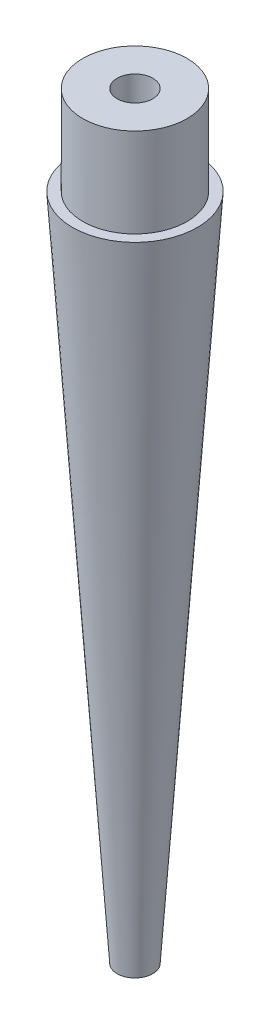
ISO-10303-21;
HEADER;
FILE_DESCRIPTION(('STEP AP214'),'2;1');
FILE_NAME('part.step','',(''),(''),'','','');
FILE_SCHEMA(('AUTOMOTIVE_DESIGN { 1 0 10303 214 1 1 1 1 }'));
ENDSEC;
DATA;
#1=APPLICATION_CONTEXT('core data for automotive mechanical design processes');
#2=APPLICATION_PROTOCOL_DEFINITION('international standard','automotive_design',2000,#1);
#3=PRODUCT_CONTEXT('',#1,'mechanical');
#4=PRODUCT('Part','Part','',(#3));
#5=PRODUCT_RELATED_PRODUCT_CATEGORY('part','',(#4));
#6=PRODUCT_DEFINITION_FORMATION('','',#4);
#7=PRODUCT_DEFINITION_CONTEXT('part definition',#1,'design');
#8=PRODUCT_DEFINITION('design','',#6,#7);
#9=PRODUCT_DEFINITION_SHAPE('','',#8);
#10=(LENGTH_UNIT() NAMED_UNIT(*) SI_UNIT(.MILLI.,.METRE.));
#11=(NAMED_UNIT(*) PLANE_ANGLE_UNIT() SI_UNIT($,.RADIAN.));
#12=(NAMED_UNIT(*) SI_UNIT($,.STERADIAN.) SOLID_ANGLE_UNIT());
#13=UNCERTAINTY_MEASURE_WITH_UNIT(LENGTH_MEASURE(1.E-05),#10,'distance_accuracy_value','');
#14=(GEOMETRIC_REPRESENTATION_CONTEXT(3) GLOBAL_UNCERTAINTY_ASSIGNED_CONTEXT((#13)) GLOBAL_UNIT_ASSIGNED_CONTEXT((#10,
#11,#12)) REPRESENTATION_CONTEXT('',''));
#15=CARTESIAN_POINT('',(0.,0.,0.));
#16=DIRECTION('',(0.,0.,1.));
#17=DIRECTION('',(1.,0.,0.));
#18=AXIS2_PLACEMENT_3D('',#15,#16,#17);
#19=CARTESIAN_POINT('',(0.,0.,0.));
#20=DIRECTION('',(0.,1.,0.));
#21=DIRECTION('',(0.,0.,1.));
#22=AXIS2_PLACEMENT_3D('',#19,#20,#21);
#23=CONICAL_SURFACE('',#22,7.,0.0665681637758238);
#24=CARTESIAN_POINT('',(0.,-75.,0.));
#25=DIRECTION('',(0.,1.,0.));
#26=DIRECTION('',(0.,0.,1.));
#27=AXIS2_PLACEMENT_3D('',#24,#25,#26);
#28=CIRCLE('',#27,2.);
#29=CARTESIAN_POINT('',(0.,-75.,1.99999999999999));
#30=VERTEX_POINT('',#29);
#31=EDGE_CURVE('E48',#30,#30,#28,.F.);
#32=ORIENTED_EDGE('',*,*,#31,.F.);
#33=EDGE_LOOP('',(#32));
#34=FACE_BOUND('',#33,.T.);
#35=CARTESIAN_POINT('',(0.,0.,0.));
#36=DIRECTION('',(0.,1.,0.));
#37=DIRECTION('',(0.,0.,1.));
#38=AXIS2_PLACEMENT_3D('',#35,#36,#37);
#39=CIRCLE('',#38,7.);
#40=CARTESIAN_POINT('',(0.,0.,7.));
#41=VERTEX_POINT('',#40);
#42=EDGE_CURVE('E40',#41,#41,#39,.T.);
#43=ORIENTED_EDGE('',*,*,#42,.F.);
#44=EDGE_LOOP('',(#43));
#45=FACE_BOUND('',#44,.T.);
#46=ADVANCED_FACE('F34',(#34,#45),#23,.T.);
#47=CARTESIAN_POINT('',(0.,0.,0.));
#48=DIRECTION('',(0.,-1.,0.));
#49=DIRECTION('',(0.,0.,-1.));
#50=AXIS2_PLACEMENT_3D('',#47,#48,#49);
#51=PLANE('',#50);
#52=CARTESIAN_POINT('',(0.,0.,0.));
#53=DIRECTION('',(0.,-1.,0.));
#54=DIRECTION('',(0.,0.,-1.));
#55=AXIS2_PLACEMENT_3D('',#52,#53,#54);
#56=CIRCLE('',#55,5.85);
#57=CARTESIAN_POINT('',(0.,0.,-5.85));
#58=VERTEX_POINT('',#57);
#59=EDGE_CURVE('E10',#58,#58,#56,.F.);
#60=ORIENTED_EDGE('',*,*,#59,.F.);
#61=EDGE_LOOP('',(#60));
#62=FACE_BOUND('',#61,.T.);
#63=ORIENTED_EDGE('',*,*,#42,.T.);
#64=EDGE_LOOP('',(#63));
#65=FACE_BOUND('',#64,.T.);
#66=ADVANCED_FACE('F67',(#62,#65),#51,.F.);
#67=CARTESIAN_POINT('',(0.,10.,0.));
#68=DIRECTION('',(0.,-1.,0.));
#69=DIRECTION('',(0.,0.,-1.));
#70=AXIS2_PLACEMENT_3D('',#67,#68,#69);
#71=CYLINDRICAL_SURFACE('',#70,5.85);
#72=CARTESIAN_POINT('',(0.,10.,0.));
#73=DIRECTION('',(0.,1.,0.));
#74=DIRECTION('',(0.,0.,1.));
#75=AXIS2_PLACEMENT_3D('',#72,#73,#74);
#76=CIRCLE('',#75,5.85);
#77=CARTESIAN_POINT('',(0.,10.,5.85));
#78=VERTEX_POINT('',#77);
#79=EDGE_CURVE('E44',#78,#78,#76,.T.);
#80=ORIENTED_EDGE('',*,*,#79,.F.);
#81=EDGE_LOOP('',(#80));
#82=FACE_BOUND('',#81,.T.);
#83=ORIENTED_EDGE('',*,*,#59,.T.);
#84=EDGE_LOOP('',(#83));
#85=FACE_BOUND('',#84,.T.);
#86=ADVANCED_FACE('F62',(#82,#85),#71,.T.);
#87=CARTESIAN_POINT('',(0.,10.,0.));
#88=DIRECTION('',(0.,1.,0.));
#89=DIRECTION('',(0.,0.,1.));
#90=AXIS2_PLACEMENT_3D('',#87,#88,#89);
#91=PLANE('',#90);
#92=CARTESIAN_POINT('',(0.,10.,0.));
#93=DIRECTION('',(0.,1.,0.));
#94=DIRECTION('',(0.,0.,1.));
#95=AXIS2_PLACEMENT_3D('',#92,#93,#94);
#96=CIRCLE('',#95,2.);
#97=CARTESIAN_POINT('',(0.,10.,2.));
#98=VERTEX_POINT('',#97);
#99=EDGE_CURVE('E53',#98,#98,#96,.T.);
#100=ORIENTED_EDGE('',*,*,#99,.F.);
#101=EDGE_LOOP('',(#100));
#102=FACE_BOUND('',#101,.T.);
#103=ORIENTED_EDGE('',*,*,#79,.T.);
#104=EDGE_LOOP('',(#103));
#105=FACE_BOUND('',#104,.T.);
#106=ADVANCED_FACE('F59',(#102,#105),#91,.T.);
#107=CARTESIAN_POINT('',(0.,-105.,0.));
#108=DIRECTION('',(0.,1.,0.));
#109=DIRECTION('',(0.,0.,1.));
#110=AXIS2_PLACEMENT_3D('',#107,#108,#109);
#111=CYLINDRICAL_SURFACE('',#110,2.);
#112=ORIENTED_EDGE('',*,*,#31,.T.);
#113=EDGE_LOOP('',(#112));
#114=FACE_BOUND('',#113,.T.);
#115=ORIENTED_EDGE('',*,*,#99,.T.);
#116=EDGE_LOOP('',(#115));
#117=FACE_BOUND('',#116,.T.);
#118=ADVANCED_FACE('F57',(#114,#117),#111,.F.);
#119=CLOSED_SHELL('',(#46,#66,#86,#106,#118));
#120=MANIFOLD_SOLID_BREP('B2',#119);
#121=ADVANCED_BREP_SHAPE_REPRESENTATION('',(#18,#120),#14);
#122=SHAPE_DEFINITION_REPRESENTATION(#9,#121);
ENDSEC;
END-ISO-10303-21;
